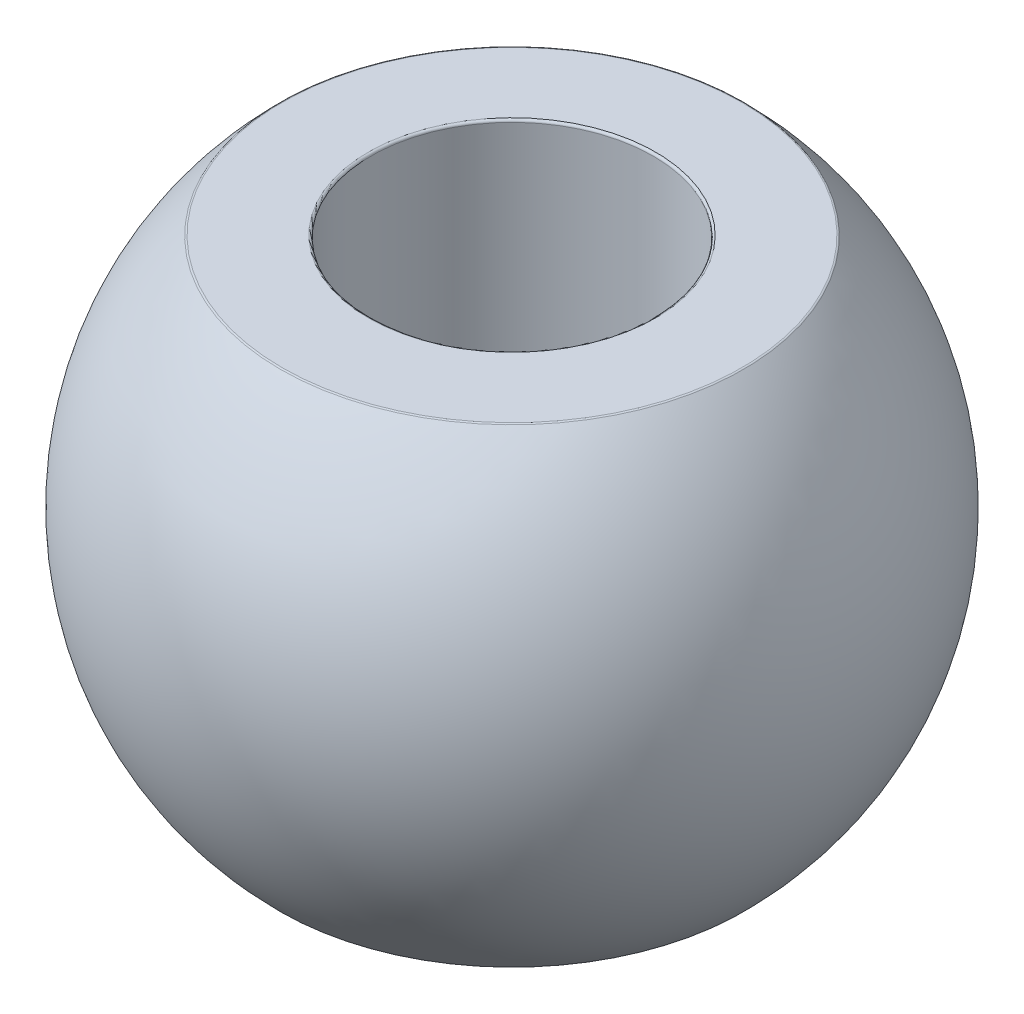
ISO-10303-21;
HEADER;
FILE_DESCRIPTION(('STEP AP214'),'2;1');
FILE_NAME('part.step','',(''),(''),'','','');
FILE_SCHEMA(('AUTOMOTIVE_DESIGN { 1 0 10303 214 1 1 1 1 }'));
ENDSEC;
DATA;
#1=APPLICATION_CONTEXT('core data for automotive mechanical design processes');
#2=APPLICATION_PROTOCOL_DEFINITION('international standard','automotive_design',2000,#1);
#3=PRODUCT_CONTEXT('',#1,'mechanical');
#4=PRODUCT('Part','Part','',(#3));
#5=PRODUCT_RELATED_PRODUCT_CATEGORY('part','',(#4));
#6=PRODUCT_DEFINITION_FORMATION('','',#4);
#7=PRODUCT_DEFINITION_CONTEXT('part definition',#1,'design');
#8=PRODUCT_DEFINITION('design','',#6,#7);
#9=PRODUCT_DEFINITION_SHAPE('','',#8);
#10=(LENGTH_UNIT() NAMED_UNIT(*) SI_UNIT(.MILLI.,.METRE.));
#11=(NAMED_UNIT(*) PLANE_ANGLE_UNIT() SI_UNIT($,.RADIAN.));
#12=(NAMED_UNIT(*) SI_UNIT($,.STERADIAN.) SOLID_ANGLE_UNIT());
#13=UNCERTAINTY_MEASURE_WITH_UNIT(LENGTH_MEASURE(1.E-05),#10,'distance_accuracy_value','');
#14=(GEOMETRIC_REPRESENTATION_CONTEXT(3) GLOBAL_UNCERTAINTY_ASSIGNED_CONTEXT((#13)) GLOBAL_UNIT_ASSIGNED_CONTEXT((#10,
#11,#12)) REPRESENTATION_CONTEXT('',''));
#15=CARTESIAN_POINT('',(0.,0.,0.));
#16=DIRECTION('',(0.,0.,1.));
#17=DIRECTION('',(1.,0.,0.));
#18=AXIS2_PLACEMENT_3D('',#15,#16,#17);
#19=CARTESIAN_POINT('',(1.5,-2.5,0.));
#20=DIRECTION('',(0.,-1.,0.));
#21=DIRECTION('',(0.,0.,-1.));
#22=AXIS2_PLACEMENT_3D('',#19,#20,#21);
#23=PLANE('',#22);
#24=CARTESIAN_POINT('',(0.,-2.5,0.));
#25=DIRECTION('',(0.,-1.,0.));
#26=DIRECTION('',(0.,0.,-1.));
#27=AXIS2_PLACEMENT_3D('',#24,#25,#26);
#28=CIRCLE('',#27,2.43926218353009);
#29=CARTESIAN_POINT('',(0.,-2.5,-2.43926218353009));
#30=VERTEX_POINT('',#29);
#31=EDGE_CURVE('E59',#30,#30,#28,.T.);
#32=ORIENTED_EDGE('',*,*,#31,.T.);
#33=EDGE_LOOP('',(#32));
#34=FACE_BOUND('',#33,.T.);
#35=CARTESIAN_POINT('',(0.,-2.5,0.));
#36=DIRECTION('',(0.,-1.,0.));
#37=DIRECTION('',(0.,0.,-1.));
#38=AXIS2_PLACEMENT_3D('',#35,#36,#37);
#39=CIRCLE('',#38,1.525);
#40=CARTESIAN_POINT('',(0.,-2.5,-1.525));
#41=VERTEX_POINT('',#40);
#42=EDGE_CURVE('E62',#41,#41,#39,.F.);
#43=ORIENTED_EDGE('',*,*,#42,.T.);
#44=EDGE_LOOP('',(#43));
#45=FACE_BOUND('',#44,.T.);
#46=ADVANCED_FACE('F33',(#34,#45),#23,.T.);
#47=CARTESIAN_POINT('',(0.,0.,0.));
#48=DIRECTION('',(0.,-1.,0.));
#49=DIRECTION('',(0.,0.,-1.));
#50=AXIS2_PLACEMENT_3D('',#47,#48,#49);
#51=CYLINDRICAL_SURFACE('',#50,1.5);
#52=CARTESIAN_POINT('',(0.,2.475,0.));
#53=DIRECTION('',(0.,1.,0.));
#54=DIRECTION('',(0.,0.,1.));
#55=AXIS2_PLACEMENT_3D('',#52,#53,#54);
#56=CIRCLE('',#55,1.5);
#57=CARTESIAN_POINT('',(0.,2.475,1.5));
#58=VERTEX_POINT('',#57);
#59=EDGE_CURVE('E10',#58,#58,#56,.T.);
#60=ORIENTED_EDGE('',*,*,#59,.T.);
#61=EDGE_LOOP('',(#60));
#62=FACE_BOUND('',#61,.T.);
#63=CARTESIAN_POINT('',(0.,-2.475,0.));
#64=DIRECTION('',(0.,-1.,0.));
#65=DIRECTION('',(0.,0.,-1.));
#66=AXIS2_PLACEMENT_3D('',#63,#64,#65);
#67=CIRCLE('',#66,1.5);
#68=CARTESIAN_POINT('',(0.,-2.475,-1.5));
#69=VERTEX_POINT('',#68);
#70=EDGE_CURVE('E40',#69,#69,#67,.T.);
#71=ORIENTED_EDGE('',*,*,#70,.T.);
#72=EDGE_LOOP('',(#71));
#73=FACE_BOUND('',#72,.T.);
#74=ADVANCED_FACE('F76',(#62,#73),#51,.F.);
#75=CARTESIAN_POINT('',(1.5,2.5,0.));
#76=DIRECTION('',(0.,1.,0.));
#77=DIRECTION('',(0.,0.,1.));
#78=AXIS2_PLACEMENT_3D('',#75,#76,#77);
#79=PLANE('',#78);
#80=CARTESIAN_POINT('',(0.,2.5,0.));
#81=DIRECTION('',(0.,1.,0.));
#82=DIRECTION('',(0.,0.,1.));
#83=AXIS2_PLACEMENT_3D('',#80,#81,#82);
#84=CIRCLE('',#83,2.43926218353009);
#85=CARTESIAN_POINT('',(0.,2.5,2.43926218353009));
#86=VERTEX_POINT('',#85);
#87=EDGE_CURVE('E44',#86,#86,#84,.T.);
#88=ORIENTED_EDGE('',*,*,#87,.T.);
#89=EDGE_LOOP('',(#88));
#90=FACE_BOUND('',#89,.T.);
#91=CARTESIAN_POINT('',(0.,2.5,0.));
#92=DIRECTION('',(0.,1.,0.));
#93=DIRECTION('',(0.,0.,1.));
#94=AXIS2_PLACEMENT_3D('',#91,#92,#93);
#95=CIRCLE('',#94,1.525);
#96=CARTESIAN_POINT('',(0.,2.5,1.525));
#97=VERTEX_POINT('',#96);
#98=EDGE_CURVE('E48',#97,#97,#95,.F.);
#99=ORIENTED_EDGE('',*,*,#98,.T.);
#100=EDGE_LOOP('',(#99));
#101=FACE_BOUND('',#100,.T.);
#102=ADVANCED_FACE('F82',(#90,#101),#79,.T.);
#103=CARTESIAN_POINT('',(0.,0.,0.));
#104=DIRECTION('',(0.,-1.,0.));
#105=DIRECTION('',(1.,0.,0.));
#106=AXIS2_PLACEMENT_3D('',#103,#104,#105);
#107=SPHERICAL_SURFACE('',#106,3.5);
#108=CARTESIAN_POINT('',(0.,-2.49280575539568,0.));
#109=DIRECTION('',(0.,1.,0.));
#110=DIRECTION('',(0.,0.,1.));
#111=AXIS2_PLACEMENT_3D('',#108,#109,#110);
#112=CIRCLE('',#111,2.45681083233247);
#113=CARTESIAN_POINT('',(0.,-2.49280575539568,2.45681083233247));
#114=VERTEX_POINT('',#113);
#115=EDGE_CURVE('E53',#114,#114,#112,.T.);
#116=ORIENTED_EDGE('',*,*,#115,.T.);
#117=EDGE_LOOP('',(#116));
#118=FACE_BOUND('',#117,.T.);
#119=CARTESIAN_POINT('',(0.,2.49280575539568,0.));
#120=DIRECTION('',(0.,-1.,0.));
#121=DIRECTION('',(0.,0.,-1.));
#122=AXIS2_PLACEMENT_3D('',#119,#120,#121);
#123=CIRCLE('',#122,2.45681083233247);
#124=CARTESIAN_POINT('',(0.,2.49280575539568,-2.45681083233247));
#125=VERTEX_POINT('',#124);
#126=EDGE_CURVE('E56',#125,#125,#123,.T.);
#127=ORIENTED_EDGE('',*,*,#126,.T.);
#128=EDGE_LOOP('',(#127));
#129=FACE_BOUND('',#128,.T.);
#130=ADVANCED_FACE('F89',(#118,#129),#107,.T.);
#131=CARTESIAN_POINT('',(0.,-2.475,0.));
#132=DIRECTION('',(0.,-1.,0.));
#133=DIRECTION('',(0.,0.,-1.));
#134=AXIS2_PLACEMENT_3D('',#131,#132,#133);
#135=TOROIDAL_SURFACE('',#134,2.43926218353009,0.025);
#136=ORIENTED_EDGE('',*,*,#115,.F.);
#137=EDGE_LOOP('',(#136));
#138=FACE_BOUND('',#137,.T.);
#139=ORIENTED_EDGE('',*,*,#31,.F.);
#140=EDGE_LOOP('',(#139));
#141=FACE_BOUND('',#140,.T.);
#142=ADVANCED_FACE('F86',(#138,#141),#135,.T.);
#143=CARTESIAN_POINT('',(0.,2.475,0.));
#144=DIRECTION('',(0.,1.,0.));
#145=DIRECTION('',(0.,0.,1.));
#146=AXIS2_PLACEMENT_3D('',#143,#144,#145);
#147=TOROIDAL_SURFACE('',#146,2.43926218353009,0.025);
#148=ORIENTED_EDGE('',*,*,#87,.F.);
#149=EDGE_LOOP('',(#148));
#150=FACE_BOUND('',#149,.T.);
#151=ORIENTED_EDGE('',*,*,#126,.F.);
#152=EDGE_LOOP('',(#151));
#153=FACE_BOUND('',#152,.T.);
#154=ADVANCED_FACE('F73',(#150,#153),#147,.T.);
#155=CARTESIAN_POINT('',(0.,2.475,0.));
#156=DIRECTION('',(0.,1.,0.));
#157=DIRECTION('',(0.,0.,1.));
#158=AXIS2_PLACEMENT_3D('',#155,#156,#157);
#159=TOROIDAL_SURFACE('',#158,1.525,0.025);
#160=ORIENTED_EDGE('',*,*,#59,.F.);
#161=EDGE_LOOP('',(#160));
#162=FACE_BOUND('',#161,.T.);
#163=ORIENTED_EDGE('',*,*,#98,.F.);
#164=EDGE_LOOP('',(#163));
#165=FACE_BOUND('',#164,.T.);
#166=ADVANCED_FACE('F69',(#162,#165),#159,.T.);
#167=CARTESIAN_POINT('',(0.,-2.475,0.));
#168=DIRECTION('',(0.,-1.,0.));
#169=DIRECTION('',(0.,0.,-1.));
#170=AXIS2_PLACEMENT_3D('',#167,#168,#169);
#171=TOROIDAL_SURFACE('',#170,1.525,0.025);
#172=ORIENTED_EDGE('',*,*,#42,.F.);
#173=EDGE_LOOP('',(#172));
#174=FACE_BOUND('',#173,.T.);
#175=ORIENTED_EDGE('',*,*,#70,.F.);
#176=EDGE_LOOP('',(#175));
#177=FACE_BOUND('',#176,.T.);
#178=ADVANCED_FACE('F35',(#174,#177),#171,.T.);
#179=CLOSED_SHELL('',(#46,#74,#102,#130,#142,#154,#166,#178));
#180=MANIFOLD_SOLID_BREP('B2',#179);
#181=ADVANCED_BREP_SHAPE_REPRESENTATION('',(#18,#180),#14);
#182=SHAPE_DEFINITION_REPRESENTATION(#9,#181);
ENDSEC;
END-ISO-10303-21;
